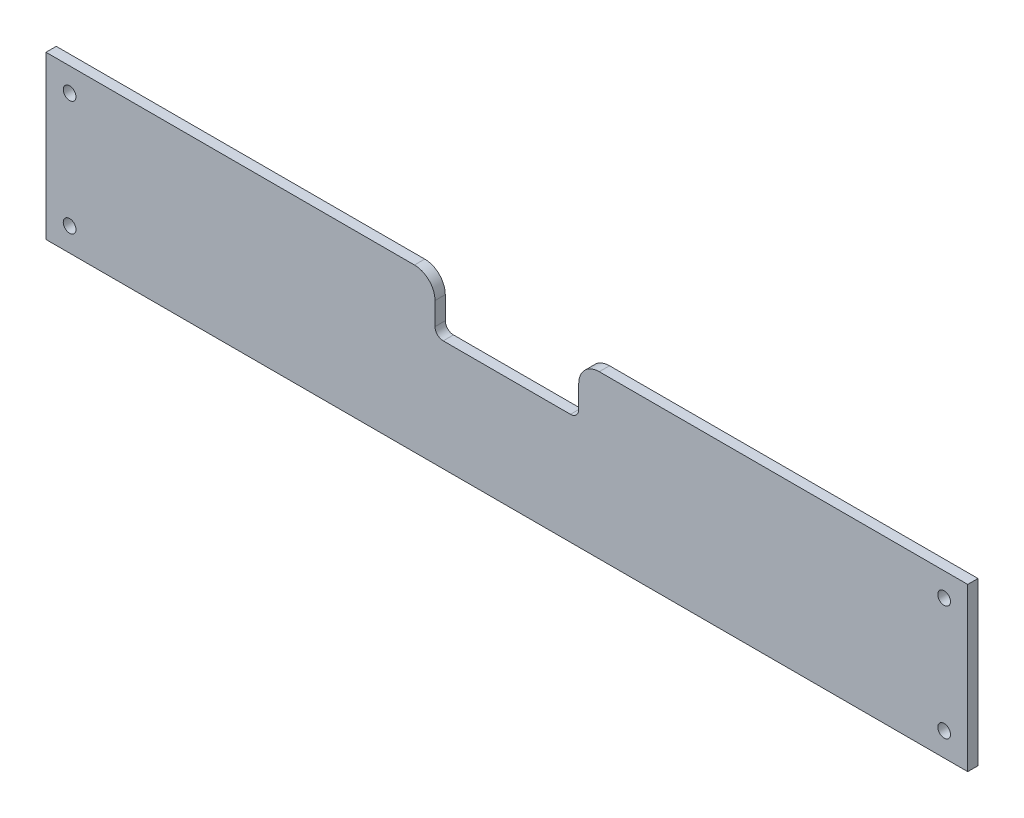
ISO-10303-21;
HEADER;
FILE_DESCRIPTION(('STEP AP214'),'2;1');
FILE_NAME('part.step','',(''),(''),'','','');
FILE_SCHEMA(('AUTOMOTIVE_DESIGN { 1 0 10303 214 1 1 1 1 }'));
ENDSEC;
DATA;
#1=APPLICATION_CONTEXT('core data for automotive mechanical design processes');
#2=APPLICATION_PROTOCOL_DEFINITION('international standard','automotive_design',2000,#1);
#3=PRODUCT_CONTEXT('',#1,'mechanical');
#4=PRODUCT('Part','Part','',(#3));
#5=PRODUCT_RELATED_PRODUCT_CATEGORY('part','',(#4));
#6=PRODUCT_DEFINITION_FORMATION('','',#4);
#7=PRODUCT_DEFINITION_CONTEXT('part definition',#1,'design');
#8=PRODUCT_DEFINITION('design','',#6,#7);
#9=PRODUCT_DEFINITION_SHAPE('','',#8);
#10=(LENGTH_UNIT() NAMED_UNIT(*) SI_UNIT(.MILLI.,.METRE.));
#11=(NAMED_UNIT(*) PLANE_ANGLE_UNIT() SI_UNIT($,.RADIAN.));
#12=(NAMED_UNIT(*) SI_UNIT($,.STERADIAN.) SOLID_ANGLE_UNIT());
#13=UNCERTAINTY_MEASURE_WITH_UNIT(LENGTH_MEASURE(1.E-05),#10,'distance_accuracy_value','');
#14=(GEOMETRIC_REPRESENTATION_CONTEXT(3) GLOBAL_UNCERTAINTY_ASSIGNED_CONTEXT((#13)) GLOBAL_UNIT_ASSIGNED_CONTEXT((#10,
#11,#12)) REPRESENTATION_CONTEXT('',''));
#15=CARTESIAN_POINT('',(0.,0.,0.));
#16=DIRECTION('',(0.,0.,1.));
#17=DIRECTION('',(1.,0.,0.));
#18=AXIS2_PLACEMENT_3D('',#15,#16,#17);
#19=CARTESIAN_POINT('',(179.5,69.,5.));
#20=DIRECTION('',(0.,0.,1.));
#21=DIRECTION('',(1.,0.,0.));
#22=AXIS2_PLACEMENT_3D('',#19,#20,#21);
#23=PLANE('',#22);
#24=CARTESIAN_POINT('',(11.5,11.5,5.));
#25=DIRECTION('',(0.,0.,1.));
#26=DIRECTION('',(-1.,0.,0.));
#27=AXIS2_PLACEMENT_3D('',#24,#25,#26);
#28=CIRCLE('',#27,3.1);
#29=CARTESIAN_POINT('',(8.4,11.5,5.));
#30=VERTEX_POINT('',#29);
#31=EDGE_CURVE('E297',#30,#30,#28,.T.);
#32=ORIENTED_EDGE('',*,*,#31,.F.);
#33=EDGE_LOOP('',(#32));
#34=FACE_BOUND('',#33,.T.);
#35=CARTESIAN_POINT('',(11.5,67.5,5.));
#36=DIRECTION('',(0.,0.,1.));
#37=DIRECTION('',(1.,0.,0.));
#38=AXIS2_PLACEMENT_3D('',#35,#36,#37);
#39=CIRCLE('',#38,3.1);
#40=CARTESIAN_POINT('',(14.6,67.5,5.));
#41=VERTEX_POINT('',#40);
#42=EDGE_CURVE('E169',#41,#41,#39,.T.);
#43=ORIENTED_EDGE('',*,*,#42,.F.);
#44=EDGE_LOOP('',(#43));
#45=FACE_BOUND('',#44,.T.);
#46=DIRECTION('',(1.,0.,0.));
#47=VECTOR('',#46,1.);
#48=CARTESIAN_POINT('',(449.,0.,5.));
#49=LINE('',#48,#47);
#50=CARTESIAN_POINT('',(0.,0.,5.));
#51=VERTEX_POINT('',#50);
#52=CARTESIAN_POINT('',(449.,0.,5.));
#53=VERTEX_POINT('',#52);
#54=EDGE_CURVE('E188',#51,#53,#49,.T.);
#55=ORIENTED_EDGE('',*,*,#54,.T.);
#56=DIRECTION('',(0.,1.,0.));
#57=VECTOR('',#56,1.);
#58=CARTESIAN_POINT('',(449.,79.,5.));
#59=LINE('',#58,#57);
#60=CARTESIAN_POINT('',(449.,79.,5.));
#61=VERTEX_POINT('',#60);
#62=EDGE_CURVE('E114',#53,#61,#59,.T.);
#63=ORIENTED_EDGE('',*,*,#62,.T.);
#64=DIRECTION('',(-1.,0.,0.));
#65=VECTOR('',#64,1.);
#66=CARTESIAN_POINT('',(269.5,79.,5.));
#67=LINE('',#66,#65);
#68=CARTESIAN_POINT('',(269.5,79.,5.));
#69=VERTEX_POINT('',#68);
#70=EDGE_CURVE('E215',#61,#69,#67,.T.);
#71=ORIENTED_EDGE('',*,*,#70,.T.);
#72=CARTESIAN_POINT('',(269.5,69.,5.));
#73=DIRECTION('',(0.,0.,1.));
#74=DIRECTION('',(-1.,0.,0.));
#75=AXIS2_PLACEMENT_3D('',#72,#73,#74);
#76=CIRCLE('',#75,10.);
#77=CARTESIAN_POINT('',(259.5,68.9999999999999,5.));
#78=VERTEX_POINT('',#77);
#79=EDGE_CURVE('E235',#69,#78,#76,.T.);
#80=ORIENTED_EDGE('',*,*,#79,.T.);
#81=DIRECTION('',(0.,-1.,0.));
#82=VECTOR('',#81,1.);
#83=CARTESIAN_POINT('',(259.5,58.,5.));
#84=LINE('',#83,#82);
#85=CARTESIAN_POINT('',(259.5,58.,5.));
#86=VERTEX_POINT('',#85);
#87=EDGE_CURVE('E231',#78,#86,#84,.T.);
#88=ORIENTED_EDGE('',*,*,#87,.T.);
#89=CARTESIAN_POINT('',(255.5,58.,5.));
#90=DIRECTION('',(0.,0.,-1.));
#91=DIRECTION('',(-1.,0.,0.));
#92=AXIS2_PLACEMENT_3D('',#89,#90,#91);
#93=CIRCLE('',#92,4.);
#94=CARTESIAN_POINT('',(255.5,54.,5.));
#95=VERTEX_POINT('',#94);
#96=EDGE_CURVE('E234',#86,#95,#93,.T.);
#97=ORIENTED_EDGE('',*,*,#96,.T.);
#98=DIRECTION('',(-1.,0.,0.));
#99=VECTOR('',#98,1.);
#100=CARTESIAN_POINT('',(255.5,54.,5.));
#101=LINE('',#100,#99);
#102=CARTESIAN_POINT('',(193.5,54.,5.));
#103=VERTEX_POINT('',#102);
#104=EDGE_CURVE('E239',#95,#103,#101,.T.);
#105=ORIENTED_EDGE('',*,*,#104,.T.);
#106=CARTESIAN_POINT('',(193.5,58.,5.));
#107=DIRECTION('',(0.,0.,-1.));
#108=DIRECTION('',(1.,0.,0.));
#109=AXIS2_PLACEMENT_3D('',#106,#107,#108);
#110=CIRCLE('',#109,4.);
#111=CARTESIAN_POINT('',(189.5,58.,5.));
#112=VERTEX_POINT('',#111);
#113=EDGE_CURVE('E257',#103,#112,#110,.T.);
#114=ORIENTED_EDGE('',*,*,#113,.T.);
#115=DIRECTION('',(0.,1.,0.));
#116=VECTOR('',#115,1.);
#117=CARTESIAN_POINT('',(189.5,58.,5.));
#118=LINE('',#117,#116);
#119=CARTESIAN_POINT('',(189.5,68.9999999999999,5.));
#120=VERTEX_POINT('',#119);
#121=EDGE_CURVE('E145',#112,#120,#118,.T.);
#122=ORIENTED_EDGE('',*,*,#121,.T.);
#123=CARTESIAN_POINT('',(179.5,69.,5.));
#124=DIRECTION('',(0.,0.,1.));
#125=DIRECTION('',(1.,0.,0.));
#126=AXIS2_PLACEMENT_3D('',#123,#124,#125);
#127=CIRCLE('',#126,10.);
#128=CARTESIAN_POINT('',(179.5,79.,5.));
#129=VERTEX_POINT('',#128);
#130=EDGE_CURVE('E139',#120,#129,#127,.T.);
#131=ORIENTED_EDGE('',*,*,#130,.T.);
#132=DIRECTION('',(-1.,0.,0.));
#133=VECTOR('',#132,1.);
#134=CARTESIAN_POINT('',(0.,79.,5.));
#135=LINE('',#134,#133);
#136=CARTESIAN_POINT('',(0.,79.,5.));
#137=VERTEX_POINT('',#136);
#138=EDGE_CURVE('E143',#129,#137,#135,.T.);
#139=ORIENTED_EDGE('',*,*,#138,.T.);
#140=DIRECTION('',(0.,-1.,0.));
#141=VECTOR('',#140,1.);
#142=CARTESIAN_POINT('',(0.,0.,5.));
#143=LINE('',#142,#141);
#144=EDGE_CURVE('E59',#137,#51,#143,.T.);
#145=ORIENTED_EDGE('',*,*,#144,.T.);
#146=EDGE_LOOP('',(#55,#63,#71,#80,#88,#97,#105,#114,#122,#131,#139,#145));
#147=FACE_BOUND('',#146,.T.);
#148=CARTESIAN_POINT('',(437.5,67.5,5.));
#149=DIRECTION('',(0.,0.,1.));
#150=DIRECTION('',(-1.,0.,0.));
#151=AXIS2_PLACEMENT_3D('',#148,#149,#150);
#152=CIRCLE('',#151,3.09999999999999);
#153=CARTESIAN_POINT('',(434.4,67.5,5.));
#154=VERTEX_POINT('',#153);
#155=EDGE_CURVE('E286',#154,#154,#152,.T.);
#156=ORIENTED_EDGE('',*,*,#155,.F.);
#157=EDGE_LOOP('',(#156));
#158=FACE_BOUND('',#157,.T.);
#159=CARTESIAN_POINT('',(437.5,11.5,5.));
#160=DIRECTION('',(0.,0.,1.));
#161=DIRECTION('',(1.,0.,0.));
#162=AXIS2_PLACEMENT_3D('',#159,#160,#161);
#163=CIRCLE('',#162,3.09999999999999);
#164=CARTESIAN_POINT('',(440.6,11.5,5.));
#165=VERTEX_POINT('',#164);
#166=EDGE_CURVE('E274',#165,#165,#163,.T.);
#167=ORIENTED_EDGE('',*,*,#166,.F.);
#168=EDGE_LOOP('',(#167));
#169=FACE_BOUND('',#168,.T.);
#170=ADVANCED_FACE('F41',(#34,#45,#147,#158,#169),#23,.T.);
#171=CARTESIAN_POINT('',(179.5,69.,0.));
#172=DIRECTION('',(0.,0.,1.));
#173=DIRECTION('',(1.,0.,0.));
#174=AXIS2_PLACEMENT_3D('',#171,#172,#173);
#175=PLANE('',#174);
#176=DIRECTION('',(1.,0.,0.));
#177=VECTOR('',#176,1.);
#178=CARTESIAN_POINT('',(449.,0.,0.));
#179=LINE('',#178,#177);
#180=CARTESIAN_POINT('',(0.,0.,0.));
#181=VERTEX_POINT('',#180);
#182=CARTESIAN_POINT('',(449.,0.,0.));
#183=VERTEX_POINT('',#182);
#184=EDGE_CURVE('E165',#181,#183,#179,.T.);
#185=ORIENTED_EDGE('',*,*,#184,.F.);
#186=DIRECTION('',(0.,-1.,0.));
#187=VECTOR('',#186,1.);
#188=CARTESIAN_POINT('',(0.,0.,0.));
#189=LINE('',#188,#187);
#190=CARTESIAN_POINT('',(0.,79.,0.));
#191=VERTEX_POINT('',#190);
#192=EDGE_CURVE('E106',#191,#181,#189,.T.);
#193=ORIENTED_EDGE('',*,*,#192,.F.);
#194=DIRECTION('',(-1.,0.,0.));
#195=VECTOR('',#194,1.);
#196=CARTESIAN_POINT('',(0.,79.,0.));
#197=LINE('',#196,#195);
#198=CARTESIAN_POINT('',(179.5,79.,0.));
#199=VERTEX_POINT('',#198);
#200=EDGE_CURVE('E100',#199,#191,#197,.T.);
#201=ORIENTED_EDGE('',*,*,#200,.F.);
#202=CARTESIAN_POINT('',(179.5,69.,0.));
#203=DIRECTION('',(0.,0.,1.));
#204=DIRECTION('',(1.,0.,0.));
#205=AXIS2_PLACEMENT_3D('',#202,#203,#204);
#206=CIRCLE('',#205,10.);
#207=CARTESIAN_POINT('',(189.5,68.9999999999999,0.));
#208=VERTEX_POINT('',#207);
#209=EDGE_CURVE('E154',#208,#199,#206,.T.);
#210=ORIENTED_EDGE('',*,*,#209,.F.);
#211=DIRECTION('',(0.,1.,0.));
#212=VECTOR('',#211,1.);
#213=CARTESIAN_POINT('',(189.5,58.,0.));
#214=LINE('',#213,#212);
#215=CARTESIAN_POINT('',(189.5,58.,0.));
#216=VERTEX_POINT('',#215);
#217=EDGE_CURVE('E183',#216,#208,#214,.T.);
#218=ORIENTED_EDGE('',*,*,#217,.F.);
#219=CARTESIAN_POINT('',(193.5,58.,0.));
#220=DIRECTION('',(0.,0.,-1.));
#221=DIRECTION('',(1.,0.,0.));
#222=AXIS2_PLACEMENT_3D('',#219,#220,#221);
#223=CIRCLE('',#222,4.);
#224=CARTESIAN_POINT('',(193.5,54.,0.));
#225=VERTEX_POINT('',#224);
#226=EDGE_CURVE('E181',#225,#216,#223,.T.);
#227=ORIENTED_EDGE('',*,*,#226,.F.);
#228=DIRECTION('',(-1.,0.,0.));
#229=VECTOR('',#228,1.);
#230=CARTESIAN_POINT('',(255.5,54.,0.));
#231=LINE('',#230,#229);
#232=CARTESIAN_POINT('',(255.5,54.,0.));
#233=VERTEX_POINT('',#232);
#234=EDGE_CURVE('E179',#233,#225,#231,.T.);
#235=ORIENTED_EDGE('',*,*,#234,.F.);
#236=CARTESIAN_POINT('',(255.5,58.,0.));
#237=DIRECTION('',(0.,0.,-1.));
#238=DIRECTION('',(-1.,0.,0.));
#239=AXIS2_PLACEMENT_3D('',#236,#237,#238);
#240=CIRCLE('',#239,4.);
#241=CARTESIAN_POINT('',(259.5,58.,0.));
#242=VERTEX_POINT('',#241);
#243=EDGE_CURVE('E177',#242,#233,#240,.T.);
#244=ORIENTED_EDGE('',*,*,#243,.F.);
#245=DIRECTION('',(0.,-1.,0.));
#246=VECTOR('',#245,1.);
#247=CARTESIAN_POINT('',(259.5,58.,0.));
#248=LINE('',#247,#246);
#249=CARTESIAN_POINT('',(259.5,68.9999999999999,0.));
#250=VERTEX_POINT('',#249);
#251=EDGE_CURVE('E175',#250,#242,#248,.T.);
#252=ORIENTED_EDGE('',*,*,#251,.F.);
#253=CARTESIAN_POINT('',(269.5,69.,0.));
#254=DIRECTION('',(0.,0.,1.));
#255=DIRECTION('',(-1.,0.,0.));
#256=AXIS2_PLACEMENT_3D('',#253,#254,#255);
#257=CIRCLE('',#256,10.);
#258=CARTESIAN_POINT('',(269.5,79.,0.));
#259=VERTEX_POINT('',#258);
#260=EDGE_CURVE('E173',#259,#250,#257,.T.);
#261=ORIENTED_EDGE('',*,*,#260,.F.);
#262=DIRECTION('',(-1.,0.,0.));
#263=VECTOR('',#262,1.);
#264=CARTESIAN_POINT('',(269.5,79.,0.));
#265=LINE('',#264,#263);
#266=CARTESIAN_POINT('',(449.,79.,0.));
#267=VERTEX_POINT('',#266);
#268=EDGE_CURVE('E171',#267,#259,#265,.T.);
#269=ORIENTED_EDGE('',*,*,#268,.F.);
#270=DIRECTION('',(0.,1.,0.));
#271=VECTOR('',#270,1.);
#272=CARTESIAN_POINT('',(449.,79.,0.));
#273=LINE('',#272,#271);
#274=EDGE_CURVE('E168',#183,#267,#273,.T.);
#275=ORIENTED_EDGE('',*,*,#274,.F.);
#276=EDGE_LOOP('',(#185,#193,#201,#210,#218,#227,#235,#244,#252,#261,#269,#275));
#277=FACE_BOUND('',#276,.T.);
#278=CARTESIAN_POINT('',(11.5,67.5,0.));
#279=DIRECTION('',(0.,0.,1.));
#280=DIRECTION('',(1.,0.,0.));
#281=AXIS2_PLACEMENT_3D('',#278,#279,#280);
#282=CIRCLE('',#281,3.1);
#283=CARTESIAN_POINT('',(14.6,67.5,0.));
#284=VERTEX_POINT('',#283);
#285=EDGE_CURVE('E292',#284,#284,#282,.T.);
#286=ORIENTED_EDGE('',*,*,#285,.T.);
#287=EDGE_LOOP('',(#286));
#288=FACE_BOUND('',#287,.T.);
#289=CARTESIAN_POINT('',(437.5,67.5,0.));
#290=DIRECTION('',(0.,0.,1.));
#291=DIRECTION('',(-1.,0.,0.));
#292=AXIS2_PLACEMENT_3D('',#289,#290,#291);
#293=CIRCLE('',#292,3.09999999999999);
#294=CARTESIAN_POINT('',(434.4,67.5,0.));
#295=VERTEX_POINT('',#294);
#296=EDGE_CURVE('E293',#295,#295,#293,.T.);
#297=ORIENTED_EDGE('',*,*,#296,.T.);
#298=EDGE_LOOP('',(#297));
#299=FACE_BOUND('',#298,.T.);
#300=CARTESIAN_POINT('',(11.5,11.5,0.));
#301=DIRECTION('',(0.,0.,1.));
#302=DIRECTION('',(-1.,0.,0.));
#303=AXIS2_PLACEMENT_3D('',#300,#301,#302);
#304=CIRCLE('',#303,3.1);
#305=CARTESIAN_POINT('',(8.4,11.5,0.));
#306=VERTEX_POINT('',#305);
#307=EDGE_CURVE('E279',#306,#306,#304,.T.);
#308=ORIENTED_EDGE('',*,*,#307,.T.);
#309=EDGE_LOOP('',(#308));
#310=FACE_BOUND('',#309,.T.);
#311=CARTESIAN_POINT('',(437.5,11.5,0.));
#312=DIRECTION('',(0.,0.,1.));
#313=DIRECTION('',(1.,0.,0.));
#314=AXIS2_PLACEMENT_3D('',#311,#312,#313);
#315=CIRCLE('',#314,3.09999999999999);
#316=CARTESIAN_POINT('',(440.6,11.5,0.));
#317=VERTEX_POINT('',#316);
#318=EDGE_CURVE('E280',#317,#317,#315,.T.);
#319=ORIENTED_EDGE('',*,*,#318,.T.);
#320=EDGE_LOOP('',(#319));
#321=FACE_BOUND('',#320,.T.);
#322=ADVANCED_FACE('F219',(#277,#288,#299,#310,#321),#175,.F.);
#323=CARTESIAN_POINT('',(449.,0.,5.));
#324=DIRECTION('',(0.,1.,0.));
#325=DIRECTION('',(-1.,0.,0.));
#326=AXIS2_PLACEMENT_3D('',#323,#324,#325);
#327=PLANE('',#326);
#328=ORIENTED_EDGE('',*,*,#184,.T.);
#329=DIRECTION('',(0.,0.,-1.));
#330=VECTOR('',#329,1.);
#331=CARTESIAN_POINT('',(449.,0.,5.));
#332=LINE('',#331,#330);
#333=EDGE_CURVE('E12',#53,#183,#332,.T.);
#334=ORIENTED_EDGE('',*,*,#333,.F.);
#335=ORIENTED_EDGE('',*,*,#54,.F.);
#336=DIRECTION('',(0.,0.,-1.));
#337=VECTOR('',#336,1.);
#338=CARTESIAN_POINT('',(0.,0.,5.));
#339=LINE('',#338,#337);
#340=EDGE_CURVE('E160',#51,#181,#339,.T.);
#341=ORIENTED_EDGE('',*,*,#340,.T.);
#342=EDGE_LOOP('',(#328,#334,#335,#341));
#343=FACE_BOUND('',#342,.T.);
#344=ADVANCED_FACE('F43',(#343),#327,.F.);
#345=CARTESIAN_POINT('',(449.,79.,5.));
#346=DIRECTION('',(-1.,0.,0.));
#347=DIRECTION('',(0.,0.,1.));
#348=AXIS2_PLACEMENT_3D('',#345,#346,#347);
#349=PLANE('',#348);
#350=ORIENTED_EDGE('',*,*,#274,.T.);
#351=DIRECTION('',(0.,0.,-1.));
#352=VECTOR('',#351,1.);
#353=CARTESIAN_POINT('',(449.,79.,5.));
#354=LINE('',#353,#352);
#355=EDGE_CURVE('E50',#61,#267,#354,.T.);
#356=ORIENTED_EDGE('',*,*,#355,.F.);
#357=ORIENTED_EDGE('',*,*,#62,.F.);
#358=ORIENTED_EDGE('',*,*,#333,.T.);
#359=EDGE_LOOP('',(#350,#356,#357,#358));
#360=FACE_BOUND('',#359,.T.);
#361=ADVANCED_FACE('F368',(#360),#349,.F.);
#362=CARTESIAN_POINT('',(269.5,79.,5.));
#363=DIRECTION('',(0.,-1.,0.));
#364=DIRECTION('',(0.,0.,-1.));
#365=AXIS2_PLACEMENT_3D('',#362,#363,#364);
#366=PLANE('',#365);
#367=ORIENTED_EDGE('',*,*,#268,.T.);
#368=DIRECTION('',(0.,0.,-1.));
#369=VECTOR('',#368,1.);
#370=CARTESIAN_POINT('',(269.5,79.,5.));
#371=LINE('',#370,#369);
#372=EDGE_CURVE('E207',#69,#259,#371,.T.);
#373=ORIENTED_EDGE('',*,*,#372,.F.);
#374=ORIENTED_EDGE('',*,*,#70,.F.);
#375=ORIENTED_EDGE('',*,*,#355,.T.);
#376=EDGE_LOOP('',(#367,#373,#374,#375));
#377=FACE_BOUND('',#376,.T.);
#378=ADVANCED_FACE('F213',(#377),#366,.F.);
#379=CARTESIAN_POINT('',(269.5,69.,5.));
#380=DIRECTION('',(0.,0.,-1.));
#381=DIRECTION('',(-1.,0.,0.));
#382=AXIS2_PLACEMENT_3D('',#379,#380,#381);
#383=CYLINDRICAL_SURFACE('',#382,10.);
#384=ORIENTED_EDGE('',*,*,#260,.T.);
#385=DIRECTION('',(0.,0.,-1.));
#386=VECTOR('',#385,1.);
#387=CARTESIAN_POINT('',(259.5,68.9999999999999,5.));
#388=LINE('',#387,#386);
#389=EDGE_CURVE('E204',#78,#250,#388,.T.);
#390=ORIENTED_EDGE('',*,*,#389,.F.);
#391=ORIENTED_EDGE('',*,*,#79,.F.);
#392=ORIENTED_EDGE('',*,*,#372,.T.);
#393=EDGE_LOOP('',(#384,#390,#391,#392));
#394=FACE_BOUND('',#393,.T.);
#395=ADVANCED_FACE('F225',(#394),#383,.T.);
#396=CARTESIAN_POINT('',(259.5,58.,5.));
#397=DIRECTION('',(1.,0.,0.));
#398=DIRECTION('',(0.,0.,-1.));
#399=AXIS2_PLACEMENT_3D('',#396,#397,#398);
#400=PLANE('',#399);
#401=ORIENTED_EDGE('',*,*,#251,.T.);
#402=DIRECTION('',(0.,0.,-1.));
#403=VECTOR('',#402,1.);
#404=CARTESIAN_POINT('',(259.5,58.,5.));
#405=LINE('',#404,#403);
#406=EDGE_CURVE('E201',#86,#242,#405,.T.);
#407=ORIENTED_EDGE('',*,*,#406,.F.);
#408=ORIENTED_EDGE('',*,*,#87,.F.);
#409=ORIENTED_EDGE('',*,*,#389,.T.);
#410=EDGE_LOOP('',(#401,#407,#408,#409));
#411=FACE_BOUND('',#410,.T.);
#412=ADVANCED_FACE('F229',(#411),#400,.F.);
#413=CARTESIAN_POINT('',(255.5,58.,5.));
#414=DIRECTION('',(0.,0.,-1.));
#415=DIRECTION('',(-1.,0.,0.));
#416=AXIS2_PLACEMENT_3D('',#413,#414,#415);
#417=CYLINDRICAL_SURFACE('',#416,4.);
#418=ORIENTED_EDGE('',*,*,#243,.T.);
#419=DIRECTION('',(0.,0.,-1.));
#420=VECTOR('',#419,1.);
#421=CARTESIAN_POINT('',(255.5,54.,5.));
#422=LINE('',#421,#420);
#423=EDGE_CURVE('E198',#95,#233,#422,.T.);
#424=ORIENTED_EDGE('',*,*,#423,.F.);
#425=ORIENTED_EDGE('',*,*,#96,.F.);
#426=ORIENTED_EDGE('',*,*,#406,.T.);
#427=EDGE_LOOP('',(#418,#424,#425,#426));
#428=FACE_BOUND('',#427,.T.);
#429=ADVANCED_FACE('F358',(#428),#417,.F.);
#430=CARTESIAN_POINT('',(255.5,54.,5.));
#431=DIRECTION('',(0.,-1.,0.));
#432=DIRECTION('',(0.,0.,-1.));
#433=AXIS2_PLACEMENT_3D('',#430,#431,#432);
#434=PLANE('',#433);
#435=ORIENTED_EDGE('',*,*,#234,.T.);
#436=DIRECTION('',(0.,0.,-1.));
#437=VECTOR('',#436,1.);
#438=CARTESIAN_POINT('',(193.5,54.,5.));
#439=LINE('',#438,#437);
#440=EDGE_CURVE('E195',#103,#225,#439,.T.);
#441=ORIENTED_EDGE('',*,*,#440,.F.);
#442=ORIENTED_EDGE('',*,*,#104,.F.);
#443=ORIENTED_EDGE('',*,*,#423,.T.);
#444=EDGE_LOOP('',(#435,#441,#442,#443));
#445=FACE_BOUND('',#444,.T.);
#446=ADVANCED_FACE('F354',(#445),#434,.F.);
#447=CARTESIAN_POINT('',(193.5,58.,5.));
#448=DIRECTION('',(0.,0.,-1.));
#449=DIRECTION('',(-1.,0.,0.));
#450=AXIS2_PLACEMENT_3D('',#447,#448,#449);
#451=CYLINDRICAL_SURFACE('',#450,4.);
#452=ORIENTED_EDGE('',*,*,#226,.T.);
#453=DIRECTION('',(0.,0.,-1.));
#454=VECTOR('',#453,1.);
#455=CARTESIAN_POINT('',(189.5,58.,5.));
#456=LINE('',#455,#454);
#457=EDGE_CURVE('E192',#112,#216,#456,.T.);
#458=ORIENTED_EDGE('',*,*,#457,.F.);
#459=ORIENTED_EDGE('',*,*,#113,.F.);
#460=ORIENTED_EDGE('',*,*,#440,.T.);
#461=EDGE_LOOP('',(#452,#458,#459,#460));
#462=FACE_BOUND('',#461,.T.);
#463=ADVANCED_FACE('F350',(#462),#451,.F.);
#464=CARTESIAN_POINT('',(189.5,58.,5.));
#465=DIRECTION('',(-1.,0.,0.));
#466=DIRECTION('',(0.,0.,1.));
#467=AXIS2_PLACEMENT_3D('',#464,#465,#466);
#468=PLANE('',#467);
#469=ORIENTED_EDGE('',*,*,#217,.T.);
#470=DIRECTION('',(0.,0.,-1.));
#471=VECTOR('',#470,1.);
#472=CARTESIAN_POINT('',(189.5,68.9999999999999,5.));
#473=LINE('',#472,#471);
#474=EDGE_CURVE('E155',#120,#208,#473,.T.);
#475=ORIENTED_EDGE('',*,*,#474,.F.);
#476=ORIENTED_EDGE('',*,*,#121,.F.);
#477=ORIENTED_EDGE('',*,*,#457,.T.);
#478=EDGE_LOOP('',(#469,#475,#476,#477));
#479=FACE_BOUND('',#478,.T.);
#480=ADVANCED_FACE('F347',(#479),#468,.F.);
#481=CARTESIAN_POINT('',(179.5,69.,5.));
#482=DIRECTION('',(0.,0.,-1.));
#483=DIRECTION('',(-1.,0.,0.));
#484=AXIS2_PLACEMENT_3D('',#481,#482,#483);
#485=CYLINDRICAL_SURFACE('',#484,10.);
#486=ORIENTED_EDGE('',*,*,#209,.T.);
#487=DIRECTION('',(0.,0.,-1.));
#488=VECTOR('',#487,1.);
#489=CARTESIAN_POINT('',(179.5,79.,5.));
#490=LINE('',#489,#488);
#491=EDGE_CURVE('E151',#129,#199,#490,.T.);
#492=ORIENTED_EDGE('',*,*,#491,.F.);
#493=ORIENTED_EDGE('',*,*,#130,.F.);
#494=ORIENTED_EDGE('',*,*,#474,.T.);
#495=EDGE_LOOP('',(#486,#492,#493,#494));
#496=FACE_BOUND('',#495,.T.);
#497=ADVANCED_FACE('F152',(#496),#485,.T.);
#498=CARTESIAN_POINT('',(0.,79.,5.));
#499=DIRECTION('',(0.,-1.,0.));
#500=DIRECTION('',(0.,0.,-1.));
#501=AXIS2_PLACEMENT_3D('',#498,#499,#500);
#502=PLANE('',#501);
#503=ORIENTED_EDGE('',*,*,#200,.T.);
#504=DIRECTION('',(0.,0.,-1.));
#505=VECTOR('',#504,1.);
#506=CARTESIAN_POINT('',(0.,79.,5.));
#507=LINE('',#506,#505);
#508=EDGE_CURVE('E156',#137,#191,#507,.T.);
#509=ORIENTED_EDGE('',*,*,#508,.F.);
#510=ORIENTED_EDGE('',*,*,#138,.F.);
#511=ORIENTED_EDGE('',*,*,#491,.T.);
#512=EDGE_LOOP('',(#503,#509,#510,#511));
#513=FACE_BOUND('',#512,.T.);
#514=ADVANCED_FACE('F158',(#513),#502,.F.);
#515=CARTESIAN_POINT('',(0.,0.,5.));
#516=DIRECTION('',(1.,0.,0.));
#517=DIRECTION('',(0.,1.,0.));
#518=AXIS2_PLACEMENT_3D('',#515,#516,#517);
#519=PLANE('',#518);
#520=ORIENTED_EDGE('',*,*,#192,.T.);
#521=ORIENTED_EDGE('',*,*,#340,.F.);
#522=ORIENTED_EDGE('',*,*,#144,.F.);
#523=ORIENTED_EDGE('',*,*,#508,.T.);
#524=EDGE_LOOP('',(#520,#521,#522,#523));
#525=FACE_BOUND('',#524,.T.);
#526=ADVANCED_FACE('F340',(#525),#519,.F.);
#527=CARTESIAN_POINT('',(11.5,67.5,5.));
#528=DIRECTION('',(0.,0.,-1.));
#529=DIRECTION('',(-1.,0.,0.));
#530=AXIS2_PLACEMENT_3D('',#527,#528,#529);
#531=CYLINDRICAL_SURFACE('',#530,3.1);
#532=ORIENTED_EDGE('',*,*,#42,.T.);
#533=EDGE_LOOP('',(#532));
#534=FACE_BOUND('',#533,.T.);
#535=ORIENTED_EDGE('',*,*,#285,.F.);
#536=EDGE_LOOP('',(#535));
#537=FACE_BOUND('',#536,.T.);
#538=ADVANCED_FACE('F327',(#534,#537),#531,.F.);
#539=CARTESIAN_POINT('',(437.5,67.5,5.));
#540=DIRECTION('',(0.,0.,-1.));
#541=DIRECTION('',(-1.,0.,0.));
#542=AXIS2_PLACEMENT_3D('',#539,#540,#541);
#543=CYLINDRICAL_SURFACE('',#542,3.09999999999999);
#544=ORIENTED_EDGE('',*,*,#155,.T.);
#545=EDGE_LOOP('',(#544));
#546=FACE_BOUND('',#545,.T.);
#547=ORIENTED_EDGE('',*,*,#296,.F.);
#548=EDGE_LOOP('',(#547));
#549=FACE_BOUND('',#548,.T.);
#550=ADVANCED_FACE('F319',(#546,#549),#543,.F.);
#551=CARTESIAN_POINT('',(11.5,11.5,5.));
#552=DIRECTION('',(0.,0.,-1.));
#553=DIRECTION('',(-1.,0.,0.));
#554=AXIS2_PLACEMENT_3D('',#551,#552,#553);
#555=CYLINDRICAL_SURFACE('',#554,3.1);
#556=ORIENTED_EDGE('',*,*,#31,.T.);
#557=EDGE_LOOP('',(#556));
#558=FACE_BOUND('',#557,.T.);
#559=ORIENTED_EDGE('',*,*,#307,.F.);
#560=EDGE_LOOP('',(#559));
#561=FACE_BOUND('',#560,.T.);
#562=ADVANCED_FACE('F316',(#558,#561),#555,.F.);
#563=CARTESIAN_POINT('',(437.5,11.5,5.));
#564=DIRECTION('',(0.,0.,-1.));
#565=DIRECTION('',(-1.,0.,0.));
#566=AXIS2_PLACEMENT_3D('',#563,#564,#565);
#567=CYLINDRICAL_SURFACE('',#566,3.09999999999999);
#568=ORIENTED_EDGE('',*,*,#166,.T.);
#569=EDGE_LOOP('',(#568));
#570=FACE_BOUND('',#569,.T.);
#571=ORIENTED_EDGE('',*,*,#318,.F.);
#572=EDGE_LOOP('',(#571));
#573=FACE_BOUND('',#572,.T.);
#574=ADVANCED_FACE('F318',(#570,#573),#567,.F.);
#575=CLOSED_SHELL('',(#170,#322,#344,#361,#378,#395,#412,#429,#446,#463,#480,#497,#514,#526,
#538,#550,#562,#574));
#576=MANIFOLD_SOLID_BREP('B2',#575);
#577=ADVANCED_BREP_SHAPE_REPRESENTATION('',(#18,#576),#14);
#578=SHAPE_DEFINITION_REPRESENTATION(#9,#577);
ENDSEC;
END-ISO-10303-21;
